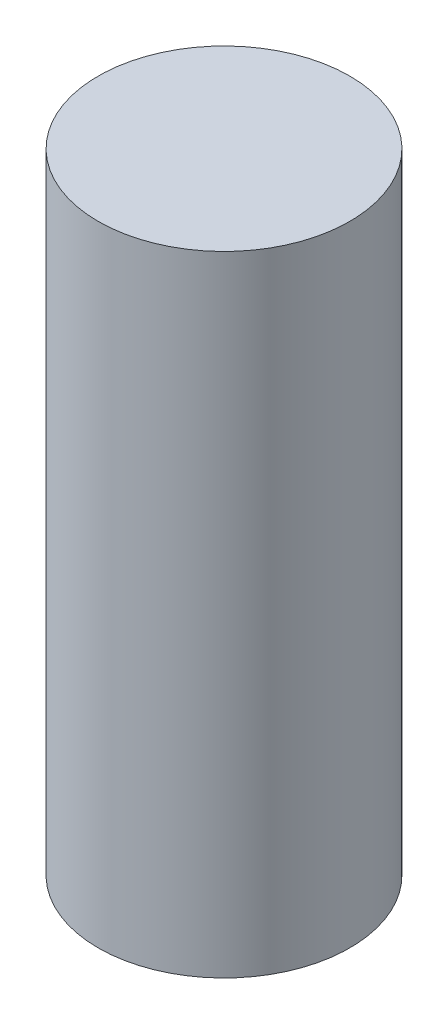
ISO-10303-21;
HEADER;
FILE_DESCRIPTION(('STEP AP214'),'2;1');
FILE_NAME('part.step','',(''),(''),'','','');
FILE_SCHEMA(('AUTOMOTIVE_DESIGN { 1 0 10303 214 1 1 1 1 }'));
ENDSEC;
DATA;
#1=APPLICATION_CONTEXT('core data for automotive mechanical design processes');
#2=APPLICATION_PROTOCOL_DEFINITION('international standard','automotive_design',2000,#1);
#3=PRODUCT_CONTEXT('',#1,'mechanical');
#4=PRODUCT('Part','Part','',(#3));
#5=PRODUCT_RELATED_PRODUCT_CATEGORY('part','',(#4));
#6=PRODUCT_DEFINITION_FORMATION('','',#4);
#7=PRODUCT_DEFINITION_CONTEXT('part definition',#1,'design');
#8=PRODUCT_DEFINITION('design','',#6,#7);
#9=PRODUCT_DEFINITION_SHAPE('','',#8);
#10=(LENGTH_UNIT() NAMED_UNIT(*) SI_UNIT(.MILLI.,.METRE.));
#11=(NAMED_UNIT(*) PLANE_ANGLE_UNIT() SI_UNIT($,.RADIAN.));
#12=(NAMED_UNIT(*) SI_UNIT($,.STERADIAN.) SOLID_ANGLE_UNIT());
#13=UNCERTAINTY_MEASURE_WITH_UNIT(LENGTH_MEASURE(1.E-05),#10,'distance_accuracy_value','');
#14=(GEOMETRIC_REPRESENTATION_CONTEXT(3) GLOBAL_UNCERTAINTY_ASSIGNED_CONTEXT((#13)) GLOBAL_UNIT_ASSIGNED_CONTEXT((#10,
#11,#12)) REPRESENTATION_CONTEXT('',''));
#15=CARTESIAN_POINT('',(0.,0.,0.));
#16=DIRECTION('',(0.,0.,1.));
#17=DIRECTION('',(1.,0.,0.));
#18=AXIS2_PLACEMENT_3D('',#15,#16,#17);
#19=CARTESIAN_POINT('',(0.,100.,0.));
#20=DIRECTION('',(0.,1.,0.));
#21=DIRECTION('',(0.,0.,1.));
#22=AXIS2_PLACEMENT_3D('',#19,#20,#21);
#23=PLANE('',#22);
#24=CARTESIAN_POINT('',(0.,100.,0.));
#25=DIRECTION('',(0.,-1.,0.));
#26=DIRECTION('',(0.,0.,-1.));
#27=AXIS2_PLACEMENT_3D('',#24,#25,#26);
#28=CIRCLE('',#27,20.);
#29=CARTESIAN_POINT('',(0.,100.,-20.));
#30=VERTEX_POINT('',#29);
#31=EDGE_CURVE('E10',#30,#30,#28,.T.);
#32=ORIENTED_EDGE('',*,*,#31,.F.);
#33=EDGE_LOOP('',(#32));
#34=FACE_BOUND('',#33,.T.);
#35=ADVANCED_FACE('F31',(#34),#23,.T.);
#36=CARTESIAN_POINT('',(0.,0.,0.));
#37=DIRECTION('',(0.,-1.,0.));
#38=DIRECTION('',(0.,0.,-1.));
#39=AXIS2_PLACEMENT_3D('',#36,#37,#38);
#40=CYLINDRICAL_SURFACE('',#39,20.);
#41=ORIENTED_EDGE('',*,*,#31,.T.);
#42=EDGE_LOOP('',(#41));
#43=FACE_BOUND('',#42,.T.);
#44=CARTESIAN_POINT('',(0.,0.,0.));
#45=DIRECTION('',(0.,-1.,0.));
#46=DIRECTION('',(0.,0.,-1.));
#47=AXIS2_PLACEMENT_3D('',#44,#45,#46);
#48=CIRCLE('',#47,20.);
#49=CARTESIAN_POINT('',(0.,0.,-20.));
#50=VERTEX_POINT('',#49);
#51=EDGE_CURVE('E37',#50,#50,#48,.T.);
#52=ORIENTED_EDGE('',*,*,#51,.F.);
#53=EDGE_LOOP('',(#52));
#54=FACE_BOUND('',#53,.T.);
#55=ADVANCED_FACE('F45',(#43,#54),#40,.T.);
#56=CARTESIAN_POINT('',(0.,0.,0.));
#57=DIRECTION('',(0.,-1.,0.));
#58=DIRECTION('',(0.,0.,-1.));
#59=AXIS2_PLACEMENT_3D('',#56,#57,#58);
#60=PLANE('',#59);
#61=ORIENTED_EDGE('',*,*,#51,.T.);
#62=EDGE_LOOP('',(#61));
#63=FACE_BOUND('',#62,.T.);
#64=ADVANCED_FACE('F43',(#63),#60,.T.);
#65=CLOSED_SHELL('',(#35,#55,#64));
#66=MANIFOLD_SOLID_BREP('B2',#65);
#67=ADVANCED_BREP_SHAPE_REPRESENTATION('',(#18,#66),#14);
#68=SHAPE_DEFINITION_REPRESENTATION(#9,#67);
ENDSEC;
END-ISO-10303-21;
